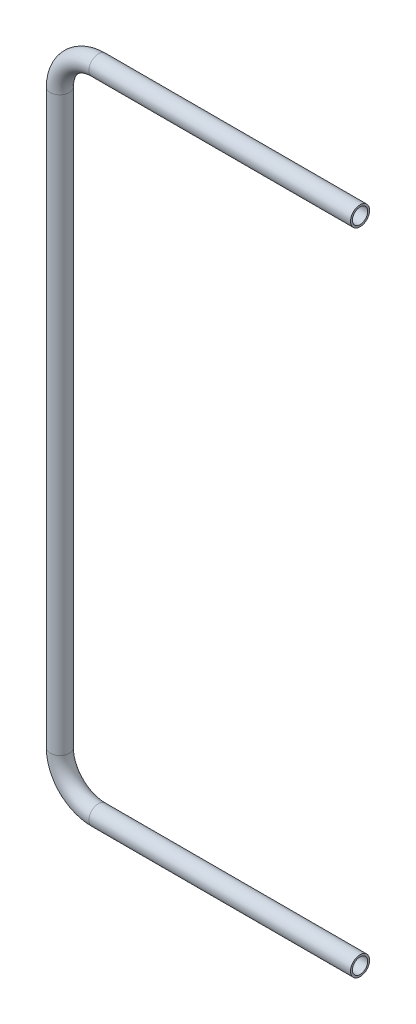
ISO-10303-21;
HEADER;
FILE_DESCRIPTION(('STEP AP214'),'2;1');
FILE_NAME('part.step','',(''),(''),'','','');
FILE_SCHEMA(('AUTOMOTIVE_DESIGN { 1 0 10303 214 1 1 1 1 }'));
ENDSEC;
DATA;
#1=APPLICATION_CONTEXT('core data for automotive mechanical design processes');
#2=APPLICATION_PROTOCOL_DEFINITION('international standard','automotive_design',2000,#1);
#3=PRODUCT_CONTEXT('',#1,'mechanical');
#4=PRODUCT('Part','Part','',(#3));
#5=PRODUCT_RELATED_PRODUCT_CATEGORY('part','',(#4));
#6=PRODUCT_DEFINITION_FORMATION('','',#4);
#7=PRODUCT_DEFINITION_CONTEXT('part definition',#1,'design');
#8=PRODUCT_DEFINITION('design','',#6,#7);
#9=PRODUCT_DEFINITION_SHAPE('','',#8);
#10=(LENGTH_UNIT() NAMED_UNIT(*) SI_UNIT(.MILLI.,.METRE.));
#11=(NAMED_UNIT(*) PLANE_ANGLE_UNIT() SI_UNIT($,.RADIAN.));
#12=(NAMED_UNIT(*) SI_UNIT($,.STERADIAN.) SOLID_ANGLE_UNIT());
#13=UNCERTAINTY_MEASURE_WITH_UNIT(LENGTH_MEASURE(1.E-05),#10,'distance_accuracy_value','');
#14=(GEOMETRIC_REPRESENTATION_CONTEXT(3) GLOBAL_UNCERTAINTY_ASSIGNED_CONTEXT((#13)) GLOBAL_UNIT_ASSIGNED_CONTEXT((#10,
#11,#12)) REPRESENTATION_CONTEXT('',''));
#15=CARTESIAN_POINT('',(0.,0.,0.));
#16=DIRECTION('',(0.,0.,1.));
#17=DIRECTION('',(1.,0.,0.));
#18=AXIS2_PLACEMENT_3D('',#15,#16,#17);
#19=CARTESIAN_POINT('',(0.,0.,0.));
#20=DIRECTION('',(-1.,0.,0.));
#21=DIRECTION('',(0.,-1.,0.));
#22=AXIS2_PLACEMENT_3D('',#19,#20,#21);
#23=CYLINDRICAL_SURFACE('',#22,16.7005);
#24=CARTESIAN_POINT('',(-457.2,0.,0.));
#25=DIRECTION('',(1.,0.,0.));
#26=DIRECTION('',(0.,0.,-1.));
#27=AXIS2_PLACEMENT_3D('',#24,#25,#26);
#28=CIRCLE('',#27,16.7005);
#29=CARTESIAN_POINT('',(-457.2,-16.7005000000001,0.));
#30=VERTEX_POINT('',#29);
#31=EDGE_CURVE('E114',#30,#30,#28,.T.);
#32=ORIENTED_EDGE('',*,*,#31,.T.);
#33=EDGE_LOOP('',(#32));
#34=FACE_BOUND('',#33,.T.);
#35=CARTESIAN_POINT('',(0.,0.,0.));
#36=DIRECTION('',(1.,0.,0.));
#37=DIRECTION('',(0.,0.,-1.));
#38=AXIS2_PLACEMENT_3D('',#35,#36,#37);
#39=CIRCLE('',#38,16.7005);
#40=CARTESIAN_POINT('',(0.,0.,-16.7005));
#41=VERTEX_POINT('',#40);
#42=EDGE_CURVE('E48',#41,#41,#39,.T.);
#43=ORIENTED_EDGE('',*,*,#42,.F.);
#44=EDGE_LOOP('',(#43));
#45=FACE_BOUND('',#44,.T.);
#46=ADVANCED_FACE('F33',(#34,#45),#23,.T.);
#47=CARTESIAN_POINT('',(-457.2,67.5004999999999,0.));
#48=DIRECTION('',(0.,0.,-1.));
#49=DIRECTION('',(-1.,0.,0.));
#50=AXIS2_PLACEMENT_3D('',#47,#48,#49);
#51=TOROIDAL_SURFACE('',#50,67.5005,16.7005);
#52=CARTESIAN_POINT('',(-524.7005,67.5004999999999,0.));
#53=DIRECTION('',(0.,-1.,0.));
#54=DIRECTION('',(0.,0.,-1.));
#55=AXIS2_PLACEMENT_3D('',#52,#53,#54);
#56=CIRCLE('',#55,16.7005);
#57=CARTESIAN_POINT('',(-541.401,67.5004999999999,0.));
#58=VERTEX_POINT('',#57);
#59=EDGE_CURVE('E117',#58,#58,#56,.T.);
#60=CARTESIAN_POINT('',(-457.2,67.5004999999999,0.));
#61=DIRECTION('',(0.,0.,-1.));
#62=DIRECTION('',(-1.,0.,0.));
#63=AXIS2_PLACEMENT_3D('',#60,#61,#62);
#64=CIRCLE('',#63,84.201);
#65=EDGE_CURVE('',#30,#58,#64,.T.);
#66=ORIENTED_EDGE('',*,*,#31,.F.);
#67=ORIENTED_EDGE('',*,*,#59,.T.);
#68=ORIENTED_EDGE('',*,*,#65,.T.);
#69=ORIENTED_EDGE('',*,*,#65,.F.);
#70=EDGE_LOOP('',(#66,#68,#67,#69));
#71=FACE_BOUND('',#70,.T.);
#72=ADVANCED_FACE('F138',(#71),#51,.T.);
#73=CARTESIAN_POINT('',(-524.7005,67.5004999999999,0.));
#74=DIRECTION('',(0.,1.,0.));
#75=DIRECTION('',(-1.,0.,0.));
#76=AXIS2_PLACEMENT_3D('',#73,#74,#75);
#77=CYLINDRICAL_SURFACE('',#76,16.7005);
#78=CARTESIAN_POINT('',(-524.7005,1067.562,0.));
#79=DIRECTION('',(0.,-1.,0.));
#80=DIRECTION('',(0.,0.,-1.));
#81=AXIS2_PLACEMENT_3D('',#78,#79,#80);
#82=CIRCLE('',#81,16.7005);
#83=CARTESIAN_POINT('',(-541.401,1067.562,0.));
#84=VERTEX_POINT('',#83);
#85=EDGE_CURVE('E119',#84,#84,#82,.T.);
#86=ORIENTED_EDGE('',*,*,#85,.T.);
#87=EDGE_LOOP('',(#86));
#88=FACE_BOUND('',#87,.T.);
#89=ORIENTED_EDGE('',*,*,#59,.F.);
#90=EDGE_LOOP('',(#89));
#91=FACE_BOUND('',#90,.T.);
#92=ADVANCED_FACE('F134',(#88,#91),#77,.T.);
#93=CARTESIAN_POINT('',(-457.2,1067.562,0.));
#94=DIRECTION('',(0.,0.,-1.));
#95=DIRECTION('',(-1.,0.,0.));
#96=AXIS2_PLACEMENT_3D('',#93,#94,#95);
#97=TOROIDAL_SURFACE('',#96,67.5005,16.7005);
#98=CARTESIAN_POINT('',(-457.2,1135.0625,0.));
#99=DIRECTION('',(-1.,0.,0.));
#100=DIRECTION('',(0.,0.,-1.));
#101=AXIS2_PLACEMENT_3D('',#98,#99,#100);
#102=CIRCLE('',#101,16.7005);
#103=CARTESIAN_POINT('',(-457.2,1151.763,0.));
#104=VERTEX_POINT('',#103);
#105=EDGE_CURVE('E37',#104,#104,#102,.T.);
#106=CARTESIAN_POINT('',(-457.2,1067.562,0.));
#107=DIRECTION('',(0.,0.,-1.));
#108=DIRECTION('',(-1.,0.,0.));
#109=AXIS2_PLACEMENT_3D('',#106,#107,#108);
#110=CIRCLE('',#109,84.201);
#111=EDGE_CURVE('',#84,#104,#110,.T.);
#112=ORIENTED_EDGE('',*,*,#85,.F.);
#113=ORIENTED_EDGE('',*,*,#105,.T.);
#114=ORIENTED_EDGE('',*,*,#111,.T.);
#115=ORIENTED_EDGE('',*,*,#111,.F.);
#116=EDGE_LOOP('',(#112,#114,#113,#115));
#117=FACE_BOUND('',#116,.T.);
#118=ADVANCED_FACE('F126',(#117),#97,.T.);
#119=CARTESIAN_POINT('',(-457.2,1135.0625,0.));
#120=DIRECTION('',(1.,0.,0.));
#121=DIRECTION('',(0.,1.,0.));
#122=AXIS2_PLACEMENT_3D('',#119,#120,#121);
#123=CYLINDRICAL_SURFACE('',#122,16.7005);
#124=CARTESIAN_POINT('',(-3.33066907387547E-13,1135.0625,0.));
#125=DIRECTION('',(-1.,0.,0.));
#126=DIRECTION('',(0.,0.,-1.));
#127=AXIS2_PLACEMENT_3D('',#124,#125,#126);
#128=CIRCLE('',#127,16.7005);
#129=CARTESIAN_POINT('',(-3.33066907387547E-13,1135.0625,-16.7005));
#130=VERTEX_POINT('',#129);
#131=EDGE_CURVE('E53',#130,#130,#128,.T.);
#132=ORIENTED_EDGE('',*,*,#131,.T.);
#133=EDGE_LOOP('',(#132));
#134=FACE_BOUND('',#133,.T.);
#135=ORIENTED_EDGE('',*,*,#105,.F.);
#136=EDGE_LOOP('',(#135));
#137=FACE_BOUND('',#136,.T.);
#138=ADVANCED_FACE('F35',(#134,#137),#123,.T.);
#139=CARTESIAN_POINT('',(0.,0.,0.));
#140=DIRECTION('',(1.,0.,0.));
#141=DIRECTION('',(0.,0.,-1.));
#142=AXIS2_PLACEMENT_3D('',#139,#140,#141);
#143=PLANE('',#142);
#144=CARTESIAN_POINT('',(0.,0.,0.));
#145=DIRECTION('',(1.,0.,0.));
#146=DIRECTION('',(0.,0.,-1.));
#147=AXIS2_PLACEMENT_3D('',#144,#145,#146);
#148=CIRCLE('',#147,13.335);
#149=CARTESIAN_POINT('',(0.,0.,-13.335));
#150=VERTEX_POINT('',#149);
#151=EDGE_CURVE('E101',#150,#150,#148,.F.);
#152=ORIENTED_EDGE('',*,*,#151,.T.);
#153=EDGE_LOOP('',(#152));
#154=FACE_BOUND('',#153,.T.);
#155=ORIENTED_EDGE('',*,*,#42,.T.);
#156=EDGE_LOOP('',(#155));
#157=FACE_BOUND('',#156,.T.);
#158=ADVANCED_FACE('F66',(#154,#157),#143,.T.);
#159=CARTESIAN_POINT('',(-3.33066907387547E-13,1135.0625,0.));
#160=DIRECTION('',(-1.,0.,0.));
#161=DIRECTION('',(0.,0.,-1.));
#162=AXIS2_PLACEMENT_3D('',#159,#160,#161);
#163=PLANE('',#162);
#164=CARTESIAN_POINT('',(-3.33066907387547E-13,1135.0625,0.));
#165=DIRECTION('',(-1.,0.,0.));
#166=DIRECTION('',(0.,0.,-1.));
#167=AXIS2_PLACEMENT_3D('',#164,#165,#166);
#168=CIRCLE('',#167,13.335);
#169=CARTESIAN_POINT('',(-3.33066907387547E-13,1135.0625,-13.335));
#170=VERTEX_POINT('',#169);
#171=EDGE_CURVE('E11',#170,#170,#168,.F.);
#172=ORIENTED_EDGE('',*,*,#171,.F.);
#173=EDGE_LOOP('',(#172));
#174=FACE_BOUND('',#173,.T.);
#175=ORIENTED_EDGE('',*,*,#131,.F.);
#176=EDGE_LOOP('',(#175));
#177=FACE_BOUND('',#176,.T.);
#178=ADVANCED_FACE('F63',(#174,#177),#163,.F.);
#179=CARTESIAN_POINT('',(0.,0.,0.));
#180=DIRECTION('',(-1.,0.,0.));
#181=DIRECTION('',(0.,-1.,0.));
#182=AXIS2_PLACEMENT_3D('',#179,#180,#181);
#183=CYLINDRICAL_SURFACE('',#182,13.335);
#184=CARTESIAN_POINT('',(-457.2,0.,0.));
#185=DIRECTION('',(1.,0.,0.));
#186=DIRECTION('',(0.,0.,-1.));
#187=AXIS2_PLACEMENT_3D('',#184,#185,#186);
#188=CIRCLE('',#187,13.335);
#189=CARTESIAN_POINT('',(-457.2,-13.3350000000001,0.));
#190=VERTEX_POINT('',#189);
#191=EDGE_CURVE('E100',#190,#190,#188,.F.);
#192=ORIENTED_EDGE('',*,*,#191,.T.);
#193=EDGE_LOOP('',(#192));
#194=FACE_BOUND('',#193,.T.);
#195=ORIENTED_EDGE('',*,*,#151,.F.);
#196=EDGE_LOOP('',(#195));
#197=FACE_BOUND('',#196,.T.);
#198=ADVANCED_FACE('F65',(#194,#197),#183,.F.);
#199=CARTESIAN_POINT('',(-457.2,67.5004999999999,0.));
#200=DIRECTION('',(0.,0.,-1.));
#201=DIRECTION('',(-1.,0.,0.));
#202=AXIS2_PLACEMENT_3D('',#199,#200,#201);
#203=TOROIDAL_SURFACE('',#202,67.5005,13.335);
#204=CARTESIAN_POINT('',(-524.7005,67.5004999999999,0.));
#205=DIRECTION('',(0.,-1.,0.));
#206=DIRECTION('',(0.,0.,-1.));
#207=AXIS2_PLACEMENT_3D('',#204,#205,#206);
#208=CIRCLE('',#207,13.335);
#209=CARTESIAN_POINT('',(-538.0355,67.5004999999999,0.));
#210=VERTEX_POINT('',#209);
#211=EDGE_CURVE('E97',#210,#210,#208,.F.);
#212=CARTESIAN_POINT('',(-457.2,67.5004999999999,0.));
#213=DIRECTION('',(0.,0.,-1.));
#214=DIRECTION('',(-1.,0.,0.));
#215=AXIS2_PLACEMENT_3D('',#212,#213,#214);
#216=CIRCLE('',#215,80.8355);
#217=EDGE_CURVE('',#190,#210,#216,.T.);
#218=ORIENTED_EDGE('',*,*,#191,.F.);
#219=ORIENTED_EDGE('',*,*,#211,.T.);
#220=ORIENTED_EDGE('',*,*,#217,.T.);
#221=ORIENTED_EDGE('',*,*,#217,.F.);
#222=EDGE_LOOP('',(#218,#220,#219,#221));
#223=FACE_BOUND('',#222,.T.);
#224=ADVANCED_FACE('F72',(#223),#203,.F.);
#225=CARTESIAN_POINT('',(-524.7005,67.5004999999999,0.));
#226=DIRECTION('',(0.,1.,0.));
#227=DIRECTION('',(-1.,0.,0.));
#228=AXIS2_PLACEMENT_3D('',#225,#226,#227);
#229=CYLINDRICAL_SURFACE('',#228,13.335);
#230=CARTESIAN_POINT('',(-524.7005,1067.562,0.));
#231=DIRECTION('',(0.,-1.,0.));
#232=DIRECTION('',(0.,0.,-1.));
#233=AXIS2_PLACEMENT_3D('',#230,#231,#232);
#234=CIRCLE('',#233,13.335);
#235=CARTESIAN_POINT('',(-538.0355,1067.562,0.));
#236=VERTEX_POINT('',#235);
#237=EDGE_CURVE('E103',#236,#236,#234,.F.);
#238=ORIENTED_EDGE('',*,*,#237,.T.);
#239=EDGE_LOOP('',(#238));
#240=FACE_BOUND('',#239,.T.);
#241=ORIENTED_EDGE('',*,*,#211,.F.);
#242=EDGE_LOOP('',(#241));
#243=FACE_BOUND('',#242,.T.);
#244=ADVANCED_FACE('F83',(#240,#243),#229,.F.);
#245=CARTESIAN_POINT('',(-457.2,1067.562,0.));
#246=DIRECTION('',(0.,0.,-1.));
#247=DIRECTION('',(-1.,0.,0.));
#248=AXIS2_PLACEMENT_3D('',#245,#246,#247);
#249=TOROIDAL_SURFACE('',#248,67.5005,13.335);
#250=CARTESIAN_POINT('',(-457.2,1135.0625,0.));
#251=DIRECTION('',(-1.,0.,0.));
#252=DIRECTION('',(0.,0.,-1.));
#253=AXIS2_PLACEMENT_3D('',#250,#251,#252);
#254=CIRCLE('',#253,13.335);
#255=CARTESIAN_POINT('',(-457.2,1148.3975,0.));
#256=VERTEX_POINT('',#255);
#257=EDGE_CURVE('E42',#256,#256,#254,.F.);
#258=CARTESIAN_POINT('',(-457.2,1067.562,0.));
#259=DIRECTION('',(0.,0.,-1.));
#260=DIRECTION('',(-1.,0.,0.));
#261=AXIS2_PLACEMENT_3D('',#258,#259,#260);
#262=CIRCLE('',#261,80.8355);
#263=EDGE_CURVE('',#236,#256,#262,.T.);
#264=ORIENTED_EDGE('',*,*,#237,.F.);
#265=ORIENTED_EDGE('',*,*,#257,.T.);
#266=ORIENTED_EDGE('',*,*,#263,.T.);
#267=ORIENTED_EDGE('',*,*,#263,.F.);
#268=EDGE_LOOP('',(#264,#266,#265,#267));
#269=FACE_BOUND('',#268,.T.);
#270=ADVANCED_FACE('F79',(#269),#249,.F.);
#271=CARTESIAN_POINT('',(-457.2,1135.0625,0.));
#272=DIRECTION('',(1.,0.,0.));
#273=DIRECTION('',(0.,1.,0.));
#274=AXIS2_PLACEMENT_3D('',#271,#272,#273);
#275=CYLINDRICAL_SURFACE('',#274,13.335);
#276=ORIENTED_EDGE('',*,*,#171,.T.);
#277=EDGE_LOOP('',(#276));
#278=FACE_BOUND('',#277,.T.);
#279=ORIENTED_EDGE('',*,*,#257,.F.);
#280=EDGE_LOOP('',(#279));
#281=FACE_BOUND('',#280,.T.);
#282=ADVANCED_FACE('F60',(#278,#281),#275,.F.);
#283=CLOSED_SHELL('',(#46,#72,#92,#118,#138,#158,#178,#198,#224,#244,#270,#282));
#284=MANIFOLD_SOLID_BREP('B2',#283);
#285=ADVANCED_BREP_SHAPE_REPRESENTATION('',(#18,#284),#14);
#286=SHAPE_DEFINITION_REPRESENTATION(#9,#285);
ENDSEC;
END-ISO-10303-21;
